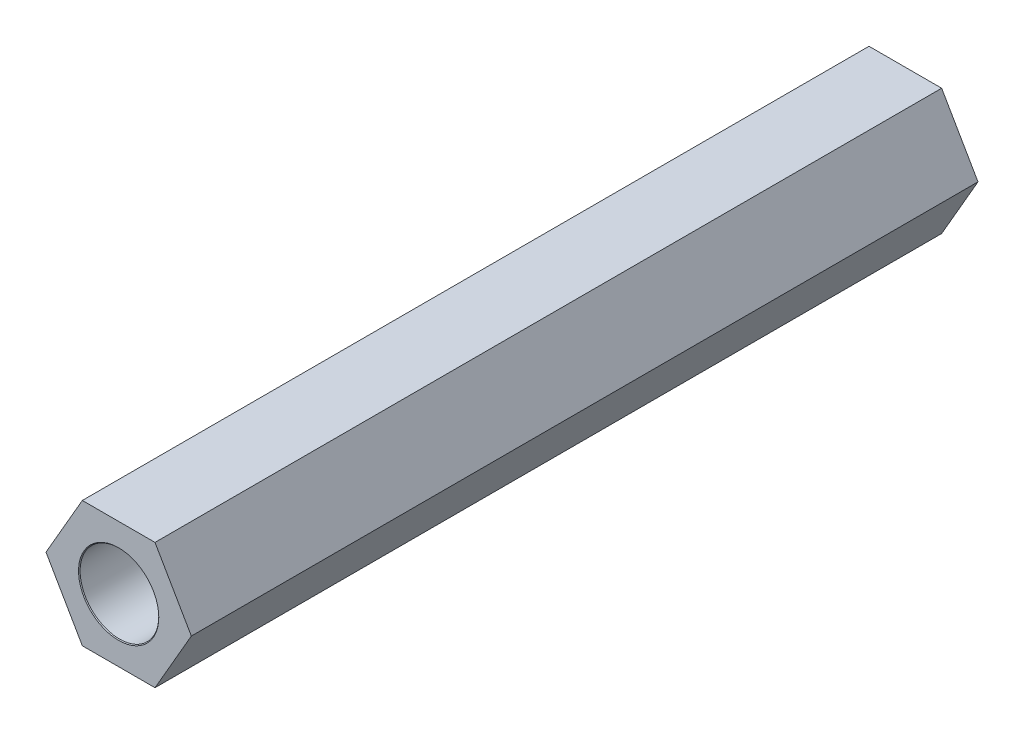
ISO-10303-21;
HEADER;
FILE_DESCRIPTION(('STEP AP214'),'2;1');
FILE_NAME('part.step','',(''),(''),'','','');
FILE_SCHEMA(('AUTOMOTIVE_DESIGN { 1 0 10303 214 1 1 1 1 }'));
ENDSEC;
DATA;
#1=APPLICATION_CONTEXT('core data for automotive mechanical design processes');
#2=APPLICATION_PROTOCOL_DEFINITION('international standard','automotive_design',2000,#1);
#3=PRODUCT_CONTEXT('',#1,'mechanical');
#4=PRODUCT('Part','Part','',(#3));
#5=PRODUCT_RELATED_PRODUCT_CATEGORY('part','',(#4));
#6=PRODUCT_DEFINITION_FORMATION('','',#4);
#7=PRODUCT_DEFINITION_CONTEXT('part definition',#1,'design');
#8=PRODUCT_DEFINITION('design','',#6,#7);
#9=PRODUCT_DEFINITION_SHAPE('','',#8);
#10=(LENGTH_UNIT() NAMED_UNIT(*) SI_UNIT(.MILLI.,.METRE.));
#11=(NAMED_UNIT(*) PLANE_ANGLE_UNIT() SI_UNIT($,.RADIAN.));
#12=(NAMED_UNIT(*) SI_UNIT($,.STERADIAN.) SOLID_ANGLE_UNIT());
#13=UNCERTAINTY_MEASURE_WITH_UNIT(LENGTH_MEASURE(1.E-05),#10,'distance_accuracy_value','');
#14=(GEOMETRIC_REPRESENTATION_CONTEXT(3) GLOBAL_UNCERTAINTY_ASSIGNED_CONTEXT((#13)) GLOBAL_UNIT_ASSIGNED_CONTEXT((#10,
#11,#12)) REPRESENTATION_CONTEXT('',''));
#15=CARTESIAN_POINT('',(0.,0.,0.));
#16=DIRECTION('',(0.,0.,1.));
#17=DIRECTION('',(1.,0.,0.));
#18=AXIS2_PLACEMENT_3D('',#15,#16,#17);
#19=CARTESIAN_POINT('',(-84.8452994616208,-118.65424363402,31.1101009266078));
#20=DIRECTION('',(-0.86602540378444,0.499999999999998,0.));
#21=DIRECTION('',(-0.499999999999998,-0.86602540378444,0.));
#22=AXIS2_PLACEMENT_3D('',#19,#20,#21);
#23=PLANE('',#22);
#24=DIRECTION('',(0.499999999999998,0.86602540378444,0.));
#25=VECTOR('',#24,1.);
#26=CARTESIAN_POINT('',(-84.8452994616208,-118.65424363402,25.));
#27=LINE('',#26,#25);
#28=CARTESIAN_POINT('',(-84.8452994616208,-118.65424363402,25.));
#29=VERTEX_POINT('',#28);
#30=CARTESIAN_POINT('',(-83.6905989232415,-116.65424363402,25.));
#31=VERTEX_POINT('',#30);
#32=EDGE_CURVE('E120',#29,#31,#27,.T.);
#33=ORIENTED_EDGE('',*,*,#32,.F.);
#34=DIRECTION('',(0.,0.,-1.));
#35=VECTOR('',#34,1.);
#36=CARTESIAN_POINT('',(-84.8452994616208,-118.65424363402,31.1101009266078));
#37=LINE('',#36,#35);
#38=CARTESIAN_POINT('',(-84.8452994616208,-118.65424363402,0.));
#39=VERTEX_POINT('',#38);
#40=EDGE_CURVE('E43',#29,#39,#37,.T.);
#41=ORIENTED_EDGE('',*,*,#40,.T.);
#42=DIRECTION('',(0.499999999999998,0.86602540378444,0.));
#43=VECTOR('',#42,1.);
#44=CARTESIAN_POINT('',(-84.8452994616208,-118.65424363402,0.));
#45=LINE('',#44,#43);
#46=CARTESIAN_POINT('',(-83.6905989232415,-116.65424363402,0.));
#47=VERTEX_POINT('',#46);
#48=EDGE_CURVE('E128',#39,#47,#45,.T.);
#49=ORIENTED_EDGE('',*,*,#48,.T.);
#50=DIRECTION('',(0.,0.,-1.));
#51=VECTOR('',#50,1.);
#52=CARTESIAN_POINT('',(-83.6905989232415,-116.65424363402,31.1101009266078));
#53=LINE('',#52,#51);
#54=EDGE_CURVE('E86',#31,#47,#53,.T.);
#55=ORIENTED_EDGE('',*,*,#54,.F.);
#56=EDGE_LOOP('',(#33,#41,#49,#55));
#57=FACE_BOUND('',#56,.T.);
#58=ADVANCED_FACE('F39',(#57),#23,.F.);
#59=CARTESIAN_POINT('',(-83.6905989232415,-116.65424363402,31.1101009266078));
#60=DIRECTION('',(-0.866025403784439,-0.5,0.));
#61=DIRECTION('',(0.5,-0.866025403784439,0.));
#62=AXIS2_PLACEMENT_3D('',#59,#60,#61);
#63=PLANE('',#62);
#64=DIRECTION('',(-0.5,0.866025403784439,0.));
#65=VECTOR('',#64,1.);
#66=CARTESIAN_POINT('',(-83.6905989232415,-116.65424363402,25.));
#67=LINE('',#66,#65);
#68=CARTESIAN_POINT('',(-84.8452994616208,-114.65424363402,25.));
#69=VERTEX_POINT('',#68);
#70=EDGE_CURVE('E93',#31,#69,#67,.T.);
#71=ORIENTED_EDGE('',*,*,#70,.F.);
#72=ORIENTED_EDGE('',*,*,#54,.T.);
#73=DIRECTION('',(-0.5,0.866025403784439,0.));
#74=VECTOR('',#73,1.);
#75=CARTESIAN_POINT('',(-83.6905989232415,-116.65424363402,0.));
#76=LINE('',#75,#74);
#77=CARTESIAN_POINT('',(-84.8452994616208,-114.65424363402,0.));
#78=VERTEX_POINT('',#77);
#79=EDGE_CURVE('E127',#47,#78,#76,.T.);
#80=ORIENTED_EDGE('',*,*,#79,.T.);
#81=DIRECTION('',(0.,0.,-1.));
#82=VECTOR('',#81,1.);
#83=CARTESIAN_POINT('',(-84.8452994616208,-114.65424363402,31.1101009266078));
#84=LINE('',#83,#82);
#85=EDGE_CURVE('E129',#69,#78,#84,.T.);
#86=ORIENTED_EDGE('',*,*,#85,.F.);
#87=EDGE_LOOP('',(#71,#72,#80,#86));
#88=FACE_BOUND('',#87,.T.);
#89=ADVANCED_FACE('F170',(#88),#63,.F.);
#90=CARTESIAN_POINT('',(-84.8452994616208,-114.65424363402,31.1101009266078));
#91=DIRECTION('',(0.,-1.,0.));
#92=DIRECTION('',(0.,0.,-1.));
#93=AXIS2_PLACEMENT_3D('',#90,#91,#92);
#94=PLANE('',#93);
#95=DIRECTION('',(-1.,0.,0.));
#96=VECTOR('',#95,1.);
#97=CARTESIAN_POINT('',(-84.8452994616208,-114.65424363402,25.));
#98=LINE('',#97,#96);
#99=CARTESIAN_POINT('',(-87.1547005383793,-114.65424363402,25.));
#100=VERTEX_POINT('',#99);
#101=EDGE_CURVE('E114',#69,#100,#98,.T.);
#102=ORIENTED_EDGE('',*,*,#101,.F.);
#103=ORIENTED_EDGE('',*,*,#85,.T.);
#104=DIRECTION('',(-1.,0.,0.));
#105=VECTOR('',#104,1.);
#106=CARTESIAN_POINT('',(-84.8452994616208,-114.65424363402,0.));
#107=LINE('',#106,#105);
#108=CARTESIAN_POINT('',(-87.1547005383793,-114.65424363402,0.));
#109=VERTEX_POINT('',#108);
#110=EDGE_CURVE('E131',#78,#109,#107,.T.);
#111=ORIENTED_EDGE('',*,*,#110,.T.);
#112=DIRECTION('',(0.,0.,-1.));
#113=VECTOR('',#112,1.);
#114=CARTESIAN_POINT('',(-87.1547005383793,-114.65424363402,31.1101009266078));
#115=LINE('',#114,#113);
#116=EDGE_CURVE('E132',#100,#109,#115,.T.);
#117=ORIENTED_EDGE('',*,*,#116,.F.);
#118=EDGE_LOOP('',(#102,#103,#111,#117));
#119=FACE_BOUND('',#118,.T.);
#120=ADVANCED_FACE('F174',(#119),#94,.F.);
#121=CARTESIAN_POINT('',(-87.1547005383793,-114.65424363402,31.1101009266078));
#122=DIRECTION('',(0.86602540378444,-0.499999999999998,0.));
#123=DIRECTION('',(0.499999999999998,0.86602540378444,0.));
#124=AXIS2_PLACEMENT_3D('',#121,#122,#123);
#125=PLANE('',#124);
#126=DIRECTION('',(-0.499999999999998,-0.86602540378444,0.));
#127=VECTOR('',#126,1.);
#128=CARTESIAN_POINT('',(-87.1547005383793,-114.65424363402,25.));
#129=LINE('',#128,#127);
#130=CARTESIAN_POINT('',(-88.3094010767585,-116.65424363402,25.));
#131=VERTEX_POINT('',#130);
#132=EDGE_CURVE('E48',#100,#131,#129,.T.);
#133=ORIENTED_EDGE('',*,*,#132,.F.);
#134=ORIENTED_EDGE('',*,*,#116,.T.);
#135=DIRECTION('',(-0.499999999999998,-0.86602540378444,0.));
#136=VECTOR('',#135,1.);
#137=CARTESIAN_POINT('',(-87.1547005383793,-114.65424363402,0.));
#138=LINE('',#137,#136);
#139=CARTESIAN_POINT('',(-88.3094010767585,-116.65424363402,0.));
#140=VERTEX_POINT('',#139);
#141=EDGE_CURVE('E109',#109,#140,#138,.T.);
#142=ORIENTED_EDGE('',*,*,#141,.T.);
#143=DIRECTION('',(0.,0.,-1.));
#144=VECTOR('',#143,1.);
#145=CARTESIAN_POINT('',(-88.3094010767585,-116.65424363402,31.1101009266078));
#146=LINE('',#145,#144);
#147=EDGE_CURVE('E100',#131,#140,#146,.T.);
#148=ORIENTED_EDGE('',*,*,#147,.F.);
#149=EDGE_LOOP('',(#133,#134,#142,#148));
#150=FACE_BOUND('',#149,.T.);
#151=ADVANCED_FACE('F106',(#150),#125,.F.);
#152=CARTESIAN_POINT('',(-88.3094010767585,-116.65424363402,31.1101009266078));
#153=DIRECTION('',(0.866025403784439,0.5,0.));
#154=DIRECTION('',(-0.5,0.866025403784439,0.));
#155=AXIS2_PLACEMENT_3D('',#152,#153,#154);
#156=PLANE('',#155);
#157=DIRECTION('',(0.5,-0.866025403784439,0.));
#158=VECTOR('',#157,1.);
#159=CARTESIAN_POINT('',(-88.3094010767585,-116.65424363402,25.));
#160=LINE('',#159,#158);
#161=CARTESIAN_POINT('',(-87.1547005383793,-118.65424363402,25.));
#162=VERTEX_POINT('',#161);
#163=EDGE_CURVE('E11',#131,#162,#160,.T.);
#164=ORIENTED_EDGE('',*,*,#163,.F.);
#165=ORIENTED_EDGE('',*,*,#147,.T.);
#166=DIRECTION('',(0.5,-0.866025403784439,0.));
#167=VECTOR('',#166,1.);
#168=CARTESIAN_POINT('',(-88.3094010767585,-116.65424363402,0.));
#169=LINE('',#168,#167);
#170=CARTESIAN_POINT('',(-87.1547005383793,-118.65424363402,0.));
#171=VERTEX_POINT('',#170);
#172=EDGE_CURVE('E111',#140,#171,#169,.T.);
#173=ORIENTED_EDGE('',*,*,#172,.T.);
#174=DIRECTION('',(0.,0.,-1.));
#175=VECTOR('',#174,1.);
#176=CARTESIAN_POINT('',(-87.1547005383793,-118.65424363402,31.1101009266078));
#177=LINE('',#176,#175);
#178=EDGE_CURVE('E61',#162,#171,#177,.T.);
#179=ORIENTED_EDGE('',*,*,#178,.F.);
#180=EDGE_LOOP('',(#164,#165,#173,#179));
#181=FACE_BOUND('',#180,.T.);
#182=ADVANCED_FACE('F99',(#181),#156,.F.);
#183=CARTESIAN_POINT('',(-87.1547005383793,-118.65424363402,31.1101009266078));
#184=DIRECTION('',(0.,1.,0.));
#185=DIRECTION('',(0.,0.,1.));
#186=AXIS2_PLACEMENT_3D('',#183,#184,#185);
#187=PLANE('',#186);
#188=DIRECTION('',(1.,0.,0.));
#189=VECTOR('',#188,1.);
#190=CARTESIAN_POINT('',(-87.1547005383793,-118.65424363402,25.));
#191=LINE('',#190,#189);
#192=EDGE_CURVE('E123',#162,#29,#191,.T.);
#193=ORIENTED_EDGE('',*,*,#192,.F.);
#194=ORIENTED_EDGE('',*,*,#178,.T.);
#195=DIRECTION('',(1.,0.,0.));
#196=VECTOR('',#195,1.);
#197=CARTESIAN_POINT('',(-87.1547005383793,-118.65424363402,0.));
#198=LINE('',#197,#196);
#199=EDGE_CURVE('E125',#171,#39,#198,.T.);
#200=ORIENTED_EDGE('',*,*,#199,.T.);
#201=ORIENTED_EDGE('',*,*,#40,.F.);
#202=EDGE_LOOP('',(#193,#194,#200,#201));
#203=FACE_BOUND('',#202,.T.);
#204=ADVANCED_FACE('F167',(#203),#187,.F.);
#205=CARTESIAN_POINT('',(0.,0.,0.));
#206=DIRECTION('',(0.,0.,1.));
#207=DIRECTION('',(1.,0.,0.));
#208=AXIS2_PLACEMENT_3D('',#205,#206,#207);
#209=PLANE('',#208);
#210=CARTESIAN_POINT('',(-86.,-116.65424363402,0.));
#211=DIRECTION('',(0.,0.,1.));
#212=DIRECTION('',(1.,0.,0.));
#213=AXIS2_PLACEMENT_3D('',#210,#211,#212);
#214=CIRCLE('',#213,1.25);
#215=CARTESIAN_POINT('',(-84.75,-116.65424363402,0.));
#216=VERTEX_POINT('',#215);
#217=EDGE_CURVE('E144',#216,#216,#214,.T.);
#218=ORIENTED_EDGE('',*,*,#217,.T.);
#219=EDGE_LOOP('',(#218));
#220=FACE_BOUND('',#219,.T.);
#221=ORIENTED_EDGE('',*,*,#48,.F.);
#222=ORIENTED_EDGE('',*,*,#199,.F.);
#223=ORIENTED_EDGE('',*,*,#172,.F.);
#224=ORIENTED_EDGE('',*,*,#141,.F.);
#225=ORIENTED_EDGE('',*,*,#110,.F.);
#226=ORIENTED_EDGE('',*,*,#79,.F.);
#227=EDGE_LOOP('',(#221,#222,#223,#224,#225,#226));
#228=FACE_BOUND('',#227,.T.);
#229=ADVANCED_FACE('F160',(#220,#228),#209,.F.);
#230=CARTESIAN_POINT('',(0.,0.,25.));
#231=DIRECTION('',(0.,0.,1.));
#232=DIRECTION('',(0.,-1.,0.));
#233=AXIS2_PLACEMENT_3D('',#230,#231,#232);
#234=PLANE('',#233);
#235=CARTESIAN_POINT('',(-86.,-116.65424363402,25.));
#236=DIRECTION('',(0.,0.,1.));
#237=DIRECTION('',(1.,0.,0.));
#238=AXIS2_PLACEMENT_3D('',#235,#236,#237);
#239=CIRCLE('',#238,1.275);
#240=CARTESIAN_POINT('',(-84.725,-116.65424363402,25.));
#241=VERTEX_POINT('',#240);
#242=EDGE_CURVE('E150',#241,#241,#239,.T.);
#243=ORIENTED_EDGE('',*,*,#242,.F.);
#244=EDGE_LOOP('',(#243));
#245=FACE_BOUND('',#244,.T.);
#246=ORIENTED_EDGE('',*,*,#192,.T.);
#247=ORIENTED_EDGE('',*,*,#32,.T.);
#248=ORIENTED_EDGE('',*,*,#70,.T.);
#249=ORIENTED_EDGE('',*,*,#101,.T.);
#250=ORIENTED_EDGE('',*,*,#132,.T.);
#251=ORIENTED_EDGE('',*,*,#163,.T.);
#252=EDGE_LOOP('',(#246,#247,#248,#249,#250,#251));
#253=FACE_BOUND('',#252,.T.);
#254=ADVANCED_FACE('F41',(#245,#253),#234,.T.);
#255=CARTESIAN_POINT('',(-86.,-116.65424363402,25.));
#256=DIRECTION('',(0.,0.,1.));
#257=DIRECTION('',(1.,0.,0.));
#258=AXIS2_PLACEMENT_3D('',#255,#256,#257);
#259=CYLINDRICAL_SURFACE('',#258,1.24999999999999);
#260=ORIENTED_EDGE('',*,*,#217,.F.);
#261=EDGE_LOOP('',(#260));
#262=FACE_BOUND('',#261,.T.);
#263=CARTESIAN_POINT('',(-86.,-116.65424363402,24.975));
#264=DIRECTION('',(0.,0.,1.));
#265=DIRECTION('',(1.,0.,0.));
#266=AXIS2_PLACEMENT_3D('',#263,#264,#265);
#267=CIRCLE('',#266,1.24999999999999);
#268=CARTESIAN_POINT('',(-84.75,-116.65424363402,24.975));
#269=VERTEX_POINT('',#268);
#270=EDGE_CURVE('E146',#269,#269,#267,.T.);
#271=ORIENTED_EDGE('',*,*,#270,.T.);
#272=EDGE_LOOP('',(#271));
#273=FACE_BOUND('',#272,.T.);
#274=ADVANCED_FACE('F159',(#262,#273),#259,.F.);
#275=CARTESIAN_POINT('',(-86.,-116.65424363402,25.));
#276=DIRECTION('',(0.,0.,1.));
#277=DIRECTION('',(1.,0.,0.));
#278=AXIS2_PLACEMENT_3D('',#275,#276,#277);
#279=CONICAL_SURFACE('',#278,1.275,0.785398163397101);
#280=ORIENTED_EDGE('',*,*,#270,.F.);
#281=EDGE_LOOP('',(#280));
#282=FACE_BOUND('',#281,.T.);
#283=ORIENTED_EDGE('',*,*,#242,.T.);
#284=EDGE_LOOP('',(#283));
#285=FACE_BOUND('',#284,.T.);
#286=ADVANCED_FACE('F156',(#282,#285),#279,.F.);
#287=CLOSED_SHELL('',(#58,#89,#120,#151,#182,#204,#229,#254,#274,#286));
#288=MANIFOLD_SOLID_BREP('B2',#287);
#289=ADVANCED_BREP_SHAPE_REPRESENTATION('',(#18,#288),#14);
#290=SHAPE_DEFINITION_REPRESENTATION(#9,#289);
ENDSEC;
END-ISO-10303-21;
